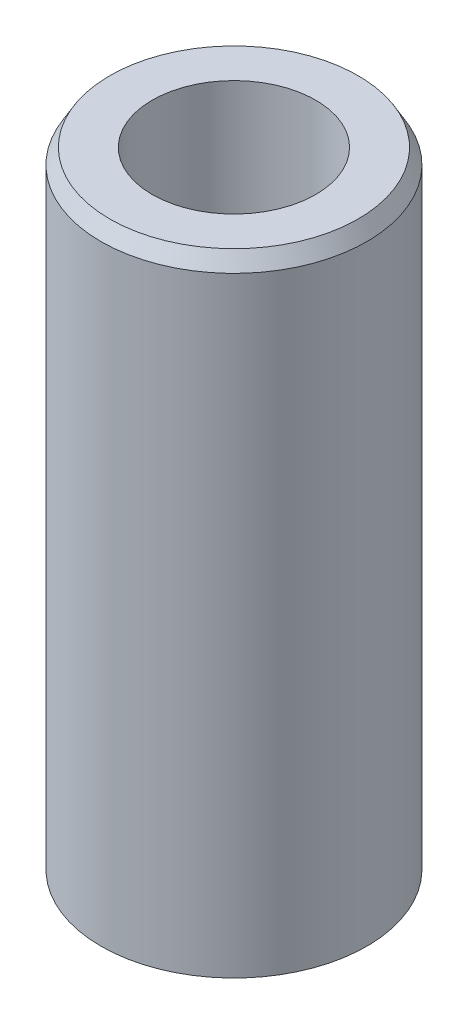
ISO-10303-21;
HEADER;
FILE_DESCRIPTION(('STEP AP214'),'2;1');
FILE_NAME('part.step','',(''),(''),'','','');
FILE_SCHEMA(('AUTOMOTIVE_DESIGN { 1 0 10303 214 1 1 1 1 }'));
ENDSEC;
DATA;
#1=APPLICATION_CONTEXT('core data for automotive mechanical design processes');
#2=APPLICATION_PROTOCOL_DEFINITION('international standard','automotive_design',2000,#1);
#3=PRODUCT_CONTEXT('',#1,'mechanical');
#4=PRODUCT('Part','Part','',(#3));
#5=PRODUCT_RELATED_PRODUCT_CATEGORY('part','',(#4));
#6=PRODUCT_DEFINITION_FORMATION('','',#4);
#7=PRODUCT_DEFINITION_CONTEXT('part definition',#1,'design');
#8=PRODUCT_DEFINITION('design','',#6,#7);
#9=PRODUCT_DEFINITION_SHAPE('','',#8);
#10=(LENGTH_UNIT() NAMED_UNIT(*) SI_UNIT(.MILLI.,.METRE.));
#11=(NAMED_UNIT(*) PLANE_ANGLE_UNIT() SI_UNIT($,.RADIAN.));
#12=(NAMED_UNIT(*) SI_UNIT($,.STERADIAN.) SOLID_ANGLE_UNIT());
#13=UNCERTAINTY_MEASURE_WITH_UNIT(LENGTH_MEASURE(1.E-05),#10,'distance_accuracy_value','');
#14=(GEOMETRIC_REPRESENTATION_CONTEXT(3) GLOBAL_UNCERTAINTY_ASSIGNED_CONTEXT((#13)) GLOBAL_UNIT_ASSIGNED_CONTEXT((#10,
#11,#12)) REPRESENTATION_CONTEXT('',''));
#15=CARTESIAN_POINT('',(0.,0.,0.));
#16=DIRECTION('',(0.,0.,1.));
#17=DIRECTION('',(1.,0.,0.));
#18=AXIS2_PLACEMENT_3D('',#15,#16,#17);
#19=CARTESIAN_POINT('',(0.,59.6294915466563,0.));
#20=DIRECTION('',(0.,-1.,0.));
#21=DIRECTION('',(0.,0.,-1.));
#22=AXIS2_PLACEMENT_3D('',#19,#20,#21);
#23=CYLINDRICAL_SURFACE('',#22,12.5);
#24=CARTESIAN_POINT('',(0.,58.2024751509441,0.));
#25=DIRECTION('',(0.,1.,0.));
#26=DIRECTION('',(0.,0.,1.));
#27=AXIS2_PLACEMENT_3D('',#24,#25,#26);
#28=CIRCLE('',#27,12.5);
#29=CARTESIAN_POINT('',(0.,58.2024751509441,12.5));
#30=VERTEX_POINT('',#29);
#31=EDGE_CURVE('E50',#30,#30,#28,.F.);
#32=ORIENTED_EDGE('',*,*,#31,.T.);
#33=EDGE_LOOP('',(#32));
#34=FACE_BOUND('',#33,.T.);
#35=CARTESIAN_POINT('',(0.,0.823888300202427,0.));
#36=DIRECTION('',(0.,1.,0.));
#37=DIRECTION('',(0.,0.,1.));
#38=AXIS2_PLACEMENT_3D('',#35,#36,#37);
#39=CIRCLE('',#38,12.5);
#40=CARTESIAN_POINT('',(0.,0.823888300202427,12.5));
#41=VERTEX_POINT('',#40);
#42=EDGE_CURVE('E51',#41,#41,#39,.T.);
#43=ORIENTED_EDGE('',*,*,#42,.T.);
#44=EDGE_LOOP('',(#43));
#45=FACE_BOUND('',#44,.T.);
#46=ADVANCED_FACE('F39',(#34,#45),#23,.T.);
#47=CARTESIAN_POINT('',(0.,59.6294915466563,0.));
#48=DIRECTION('',(0.,1.,0.));
#49=DIRECTION('',(0.,0.,1.));
#50=AXIS2_PLACEMENT_3D('',#47,#48,#49);
#51=PLANE('',#50);
#52=CARTESIAN_POINT('',(0.,59.6294915466563,0.));
#53=DIRECTION('',(0.,1.,0.));
#54=DIRECTION('',(0.,0.,1.));
#55=AXIS2_PLACEMENT_3D('',#52,#53,#54);
#56=CIRCLE('',#55,11.6761116997976);
#57=CARTESIAN_POINT('',(0.,59.6294915466563,11.6761116997976));
#58=VERTEX_POINT('',#57);
#59=EDGE_CURVE('E54',#58,#58,#56,.T.);
#60=ORIENTED_EDGE('',*,*,#59,.T.);
#61=EDGE_LOOP('',(#60));
#62=FACE_BOUND('',#61,.T.);
#63=CARTESIAN_POINT('',(0.,59.6294915466563,0.));
#64=DIRECTION('',(0.,1.,0.));
#65=DIRECTION('',(0.,0.,1.));
#66=AXIS2_PLACEMENT_3D('',#63,#64,#65);
#67=CIRCLE('',#66,7.6886056043809);
#68=CARTESIAN_POINT('',(0.,59.6294915466563,7.6886056043809));
#69=VERTEX_POINT('',#68);
#70=EDGE_CURVE('E58',#69,#69,#67,.T.);
#71=ORIENTED_EDGE('',*,*,#70,.F.);
#72=EDGE_LOOP('',(#71));
#73=FACE_BOUND('',#72,.T.);
#74=ADVANCED_FACE('F69',(#62,#73),#51,.T.);
#75=CARTESIAN_POINT('',(0.,0.,0.));
#76=DIRECTION('',(0.,1.,0.));
#77=DIRECTION('',(0.,0.,1.));
#78=AXIS2_PLACEMENT_3D('',#75,#76,#77);
#79=PLANE('',#78);
#80=CARTESIAN_POINT('',(0.,0.,0.));
#81=DIRECTION('',(0.,1.,0.));
#82=DIRECTION('',(0.,0.,1.));
#83=AXIS2_PLACEMENT_3D('',#80,#81,#82);
#84=CIRCLE('',#83,11.0729836042878);
#85=CARTESIAN_POINT('',(0.,0.,11.0729836042878));
#86=VERTEX_POINT('',#85);
#87=EDGE_CURVE('E10',#86,#86,#84,.F.);
#88=ORIENTED_EDGE('',*,*,#87,.T.);
#89=EDGE_LOOP('',(#88));
#90=FACE_BOUND('',#89,.T.);
#91=CARTESIAN_POINT('',(0.,0.,0.));
#92=DIRECTION('',(0.,1.,0.));
#93=DIRECTION('',(0.,0.,1.));
#94=AXIS2_PLACEMENT_3D('',#91,#92,#93);
#95=CIRCLE('',#94,7.6886056043809);
#96=CARTESIAN_POINT('',(0.,0.,7.6886056043809));
#97=VERTEX_POINT('',#96);
#98=EDGE_CURVE('E63',#97,#97,#95,.T.);
#99=ORIENTED_EDGE('',*,*,#98,.T.);
#100=EDGE_LOOP('',(#99));
#101=FACE_BOUND('',#100,.T.);
#102=ADVANCED_FACE('F75',(#90,#101),#79,.F.);
#103=CARTESIAN_POINT('',(0.,59.6294915466563,0.));
#104=DIRECTION('',(0.,-1.,0.));
#105=DIRECTION('',(0.,0.,-1.));
#106=AXIS2_PLACEMENT_3D('',#103,#104,#105);
#107=CYLINDRICAL_SURFACE('',#106,7.6886056043809);
#108=ORIENTED_EDGE('',*,*,#70,.T.);
#109=EDGE_LOOP('',(#108));
#110=FACE_BOUND('',#109,.T.);
#111=ORIENTED_EDGE('',*,*,#98,.F.);
#112=EDGE_LOOP('',(#111));
#113=FACE_BOUND('',#112,.T.);
#114=ADVANCED_FACE('F70',(#110,#113),#107,.F.);
#115=CARTESIAN_POINT('',(0.,59.6294915466563,0.));
#116=DIRECTION('',(0.,-1.,0.));
#117=DIRECTION('',(0.,0.,-1.));
#118=AXIS2_PLACEMENT_3D('',#115,#116,#117);
#119=CONICAL_SURFACE('',#118,11.6761116997976,0.523598775598295);
#120=ORIENTED_EDGE('',*,*,#31,.F.);
#121=EDGE_LOOP('',(#120));
#122=FACE_BOUND('',#121,.T.);
#123=ORIENTED_EDGE('',*,*,#59,.F.);
#124=EDGE_LOOP('',(#123));
#125=FACE_BOUND('',#124,.T.);
#126=ADVANCED_FACE('F81',(#122,#125),#119,.T.);
#127=CARTESIAN_POINT('',(0.,0.823888300202427,0.));
#128=DIRECTION('',(0.,1.,0.));
#129=DIRECTION('',(0.,0.,1.));
#130=AXIS2_PLACEMENT_3D('',#127,#128,#129);
#131=CONICAL_SURFACE('',#130,12.5,1.0471975511966);
#132=ORIENTED_EDGE('',*,*,#87,.F.);
#133=EDGE_LOOP('',(#132));
#134=FACE_BOUND('',#133,.T.);
#135=ORIENTED_EDGE('',*,*,#42,.F.);
#136=EDGE_LOOP('',(#135));
#137=FACE_BOUND('',#136,.T.);
#138=ADVANCED_FACE('F45',(#134,#137),#131,.T.);
#139=CLOSED_SHELL('',(#46,#74,#102,#114,#126,#138));
#140=MANIFOLD_SOLID_BREP('B2',#139);
#141=ADVANCED_BREP_SHAPE_REPRESENTATION('',(#18,#140),#14);
#142=SHAPE_DEFINITION_REPRESENTATION(#9,#141);
ENDSEC;
END-ISO-10303-21;
